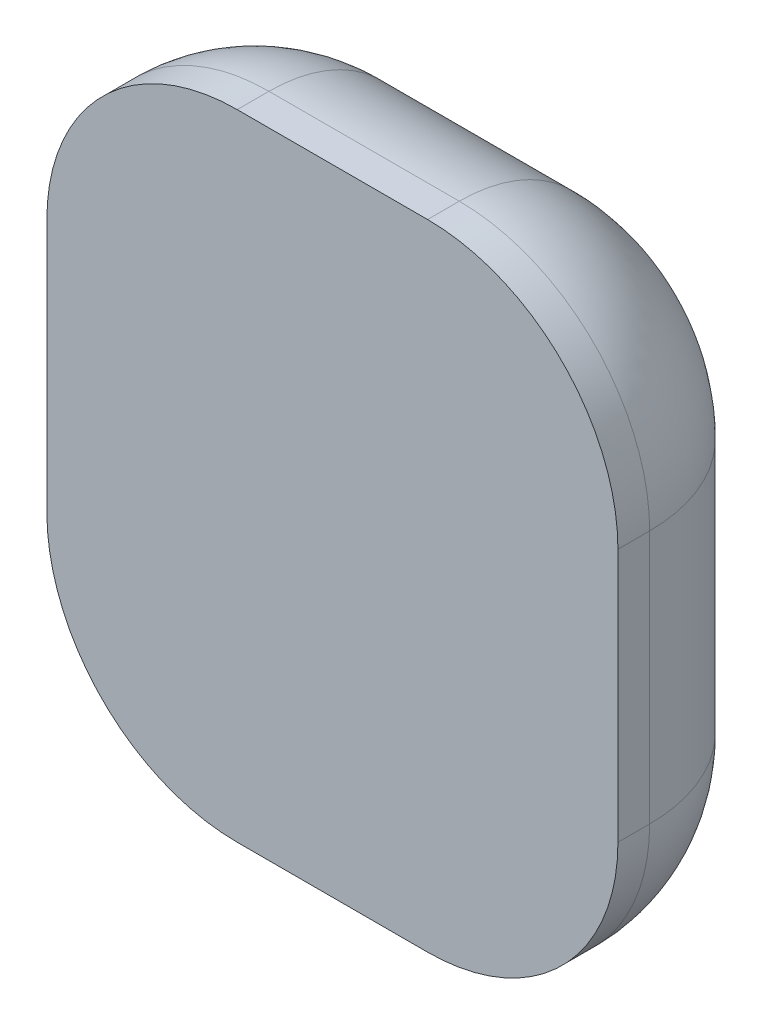
ISO-10303-21;
HEADER;
FILE_DESCRIPTION(('STEP AP214'),'2;1');
FILE_NAME('part.step','',(''),(''),'','','');
FILE_SCHEMA(('AUTOMOTIVE_DESIGN { 1 0 10303 214 1 1 1 1 }'));
ENDSEC;
DATA;
#1=APPLICATION_CONTEXT('core data for automotive mechanical design processes');
#2=APPLICATION_PROTOCOL_DEFINITION('international standard','automotive_design',2000,#1);
#3=PRODUCT_CONTEXT('',#1,'mechanical');
#4=PRODUCT('Part','Part','',(#3));
#5=PRODUCT_RELATED_PRODUCT_CATEGORY('part','',(#4));
#6=PRODUCT_DEFINITION_FORMATION('','',#4);
#7=PRODUCT_DEFINITION_CONTEXT('part definition',#1,'design');
#8=PRODUCT_DEFINITION('design','',#6,#7);
#9=PRODUCT_DEFINITION_SHAPE('','',#8);
#10=(LENGTH_UNIT() NAMED_UNIT(*) SI_UNIT(.MILLI.,.METRE.));
#11=(NAMED_UNIT(*) PLANE_ANGLE_UNIT() SI_UNIT($,.RADIAN.));
#12=(NAMED_UNIT(*) SI_UNIT($,.STERADIAN.) SOLID_ANGLE_UNIT());
#13=UNCERTAINTY_MEASURE_WITH_UNIT(LENGTH_MEASURE(1.E-05),#10,'distance_accuracy_value','');
#14=(GEOMETRIC_REPRESENTATION_CONTEXT(3) GLOBAL_UNCERTAINTY_ASSIGNED_CONTEXT((#13)) GLOBAL_UNIT_ASSIGNED_CONTEXT((#10,
#11,#12)) REPRESENTATION_CONTEXT('',''));
#15=CARTESIAN_POINT('',(0.,0.,0.));
#16=DIRECTION('',(0.,0.,1.));
#17=DIRECTION('',(1.,0.,0.));
#18=AXIS2_PLACEMENT_3D('',#15,#16,#17);
#19=CARTESIAN_POINT('',(5.64899999924089,-1.74899999924089,-7.3));
#20=DIRECTION('',(0.,0.,-1.));
#21=DIRECTION('',(1.,0.,0.));
#22=AXIS2_PLACEMENT_3D('',#19,#20,#21);
#23=PLANE('',#22);
#24=DIRECTION('',(0.,-1.,0.));
#25=VECTOR('',#24,1.);
#26=CARTESIAN_POINT('',(5.65,-2.,-7.3));
#27=LINE('',#26,#25);
#28=CARTESIAN_POINT('',(5.65,-1.8,-7.3));
#29=VERTEX_POINT('',#28);
#30=CARTESIAN_POINT('',(5.65,-2.19999999908368,-7.3));
#31=VERTEX_POINT('',#30);
#32=EDGE_CURVE('E125',#29,#31,#27,.T.);
#33=ORIENTED_EDGE('',*,*,#32,.F.);
#34=CARTESIAN_POINT('',(5.7,-1.8,-7.3));
#35=DIRECTION('',(0.,0.,-1.));
#36=DIRECTION('',(-1.,0.,0.));
#37=AXIS2_PLACEMENT_3D('',#34,#35,#36);
#38=CIRCLE('',#37,0.05);
#39=CARTESIAN_POINT('',(5.70000000091632,-1.75,-7.3));
#40=VERTEX_POINT('',#39);
#41=EDGE_CURVE('E148',#40,#29,#38,.F.);
#42=ORIENTED_EDGE('',*,*,#41,.F.);
#43=DIRECTION('',(-1.,0.,0.));
#44=VECTOR('',#43,1.);
#45=CARTESIAN_POINT('',(5.85,-1.75,-7.3));
#46=LINE('',#45,#44);
#47=CARTESIAN_POINT('',(6.,-1.75,-7.3));
#48=VERTEX_POINT('',#47);
#49=EDGE_CURVE('E92',#48,#40,#46,.T.);
#50=ORIENTED_EDGE('',*,*,#49,.F.);
#51=CARTESIAN_POINT('',(6.,-1.8,-7.3));
#52=DIRECTION('',(0.,0.,-1.));
#53=DIRECTION('',(-1.,0.,0.));
#54=AXIS2_PLACEMENT_3D('',#51,#52,#53);
#55=CIRCLE('',#54,0.0499999999999998);
#56=CARTESIAN_POINT('',(6.05,-1.8,-7.3));
#57=VERTEX_POINT('',#56);
#58=EDGE_CURVE('E21',#57,#48,#55,.F.);
#59=ORIENTED_EDGE('',*,*,#58,.F.);
#60=DIRECTION('',(0.,1.,0.));
#61=VECTOR('',#60,1.);
#62=CARTESIAN_POINT('',(6.05,-2.,-7.3));
#63=LINE('',#62,#61);
#64=CARTESIAN_POINT('',(6.05,-2.2,-7.3));
#65=VERTEX_POINT('',#64);
#66=EDGE_CURVE('E89',#65,#57,#63,.T.);
#67=ORIENTED_EDGE('',*,*,#66,.F.);
#68=CARTESIAN_POINT('',(6.,-2.2,-7.3));
#69=DIRECTION('',(0.,0.,-1.));
#70=DIRECTION('',(-1.,0.,0.));
#71=AXIS2_PLACEMENT_3D('',#68,#69,#70);
#72=CIRCLE('',#71,0.0500000000000002);
#73=CARTESIAN_POINT('',(5.99999999908368,-2.25,-7.3));
#74=VERTEX_POINT('',#73);
#75=EDGE_CURVE('E109',#74,#65,#72,.F.);
#76=ORIENTED_EDGE('',*,*,#75,.F.);
#77=DIRECTION('',(1.,0.,0.));
#78=VECTOR('',#77,1.);
#79=CARTESIAN_POINT('',(5.85,-2.25,-7.3));
#80=LINE('',#79,#78);
#81=CARTESIAN_POINT('',(5.7,-2.25,-7.3));
#82=VERTEX_POINT('',#81);
#83=EDGE_CURVE('E121',#82,#74,#80,.T.);
#84=ORIENTED_EDGE('',*,*,#83,.F.);
#85=CARTESIAN_POINT('',(5.7,-2.2,-7.3));
#86=DIRECTION('',(0.,0.,-1.));
#87=DIRECTION('',(-1.,0.,0.));
#88=AXIS2_PLACEMENT_3D('',#85,#86,#87);
#89=CIRCLE('',#88,0.0500000000000006);
#90=EDGE_CURVE('E147',#31,#82,#89,.F.);
#91=ORIENTED_EDGE('',*,*,#90,.F.);
#92=EDGE_LOOP('',(#33,#42,#50,#59,#67,#76,#84,#91));
#93=FACE_BOUND('',#92,.T.);
#94=ADVANCED_FACE('F17',(#93),#23,.T.);
#95=CARTESIAN_POINT('',(6.,-1.8,-7.05));
#96=DIRECTION('',(0.,0.,-1.));
#97=DIRECTION('',(-1.,0.,0.));
#98=AXIS2_PLACEMENT_3D('',#95,#96,#97);
#99=DEGENERATE_TOROIDAL_SURFACE('',#98,0.0500000000000003,0.25,.T.);
#100=CARTESIAN_POINT('',(6.05,-1.8,-7.05));
#101=DIRECTION('',(0.,-1.,0.));
#102=DIRECTION('',(0.,0.,-1.));
#103=AXIS2_PLACEMENT_3D('',#100,#101,#102);
#104=CIRCLE('',#103,0.25);
#105=CARTESIAN_POINT('',(6.3,-1.8,-7.05));
#106=VERTEX_POINT('',#105);
#107=EDGE_CURVE('E99',#57,#106,#104,.T.);
#108=ORIENTED_EDGE('',*,*,#107,.F.);
#109=ORIENTED_EDGE('',*,*,#58,.T.);
#110=CARTESIAN_POINT('',(6.,-1.75,-7.05));
#111=DIRECTION('',(-1.,0.,0.));
#112=DIRECTION('',(0.,0.,1.));
#113=AXIS2_PLACEMENT_3D('',#110,#111,#112);
#114=CIRCLE('',#113,0.25);
#115=CARTESIAN_POINT('',(6.,-1.5,-7.05));
#116=VERTEX_POINT('',#115);
#117=EDGE_CURVE('E96',#116,#48,#114,.T.);
#118=ORIENTED_EDGE('',*,*,#117,.F.);
#119=CARTESIAN_POINT('',(6.,-1.8,-7.05));
#120=DIRECTION('',(0.,0.,1.));
#121=DIRECTION('',(1.,0.,0.));
#122=AXIS2_PLACEMENT_3D('',#119,#120,#121);
#123=CIRCLE('',#122,0.3);
#124=EDGE_CURVE('E103',#106,#116,#123,.T.);
#125=ORIENTED_EDGE('',*,*,#124,.F.);
#126=EDGE_LOOP('',(#108,#109,#118,#125));
#127=FACE_BOUND('',#126,.T.);
#128=ADVANCED_FACE('F100',(#127),#99,.T.);
#129=CARTESIAN_POINT('',(5.7,-1.75,-7.05));
#130=DIRECTION('',(1.,0.,0.));
#131=DIRECTION('',(0.,0.,-1.));
#132=AXIS2_PLACEMENT_3D('',#129,#130,#131);
#133=CYLINDRICAL_SURFACE('',#132,0.25);
#134=ORIENTED_EDGE('',*,*,#117,.T.);
#135=ORIENTED_EDGE('',*,*,#49,.T.);
#136=CARTESIAN_POINT('',(5.70000000183265,-1.75,-7.05));
#137=DIRECTION('',(-0.999999999999999,3.66530764073225E-08,0.));
#138=DIRECTION('',(-3.66530764073225E-08,-0.999999999999999,0.));
#139=AXIS2_PLACEMENT_3D('',#136,#137,#138);
#140=CIRCLE('',#139,0.25);
#141=CARTESIAN_POINT('',(5.70000000274898,-1.5,-7.05));
#142=VERTEX_POINT('',#141);
#143=EDGE_CURVE('E130',#142,#40,#140,.T.);
#144=ORIENTED_EDGE('',*,*,#143,.F.);
#145=DIRECTION('',(-1.,0.,0.));
#146=VECTOR('',#145,1.);
#147=CARTESIAN_POINT('',(5.85,-1.5,-7.05));
#148=LINE('',#147,#146);
#149=EDGE_CURVE('E114',#116,#142,#148,.T.);
#150=ORIENTED_EDGE('',*,*,#149,.F.);
#151=EDGE_LOOP('',(#134,#135,#144,#150));
#152=FACE_BOUND('',#151,.T.);
#153=ADVANCED_FACE('F169',(#152),#133,.T.);
#154=CARTESIAN_POINT('',(5.7,-1.8,-7.05));
#155=DIRECTION('',(0.,0.,-1.));
#156=DIRECTION('',(-1.,0.,0.));
#157=AXIS2_PLACEMENT_3D('',#154,#155,#156);
#158=DEGENERATE_TOROIDAL_SURFACE('',#157,0.0500000000000006,0.25,.T.);
#159=ORIENTED_EDGE('',*,*,#143,.T.);
#160=ORIENTED_EDGE('',*,*,#41,.T.);
#161=CARTESIAN_POINT('',(5.65,-1.8,-7.05));
#162=DIRECTION('',(0.,-1.,0.));
#163=DIRECTION('',(0.,0.,-1.));
#164=AXIS2_PLACEMENT_3D('',#161,#162,#163);
#165=CIRCLE('',#164,0.25);
#166=CARTESIAN_POINT('',(5.4,-1.8,-7.05));
#167=VERTEX_POINT('',#166);
#168=EDGE_CURVE('E128',#167,#29,#165,.T.);
#169=ORIENTED_EDGE('',*,*,#168,.F.);
#170=CARTESIAN_POINT('',(5.7,-1.8,-7.05));
#171=DIRECTION('',(0.,0.,1.));
#172=DIRECTION('',(1.,0.,0.));
#173=AXIS2_PLACEMENT_3D('',#170,#171,#172);
#174=CIRCLE('',#173,0.3);
#175=EDGE_CURVE('E227',#142,#167,#174,.T.);
#176=ORIENTED_EDGE('',*,*,#175,.F.);
#177=EDGE_LOOP('',(#159,#160,#169,#176));
#178=FACE_BOUND('',#177,.T.);
#179=ADVANCED_FACE('F315',(#178),#158,.T.);
#180=CARTESIAN_POINT('',(5.65,-2.2,-7.05));
#181=DIRECTION('',(0.,1.,0.));
#182=DIRECTION('',(0.,0.,1.));
#183=AXIS2_PLACEMENT_3D('',#180,#181,#182);
#184=CYLINDRICAL_SURFACE('',#183,0.25);
#185=ORIENTED_EDGE('',*,*,#168,.T.);
#186=ORIENTED_EDGE('',*,*,#32,.T.);
#187=CARTESIAN_POINT('',(5.65,-2.19999999816735,-7.05));
#188=DIRECTION('',(-3.66530833462165E-08,-0.999999999999999,0.));
#189=DIRECTION('',(0.999999999999999,-3.66530833462165E-08,0.));
#190=AXIS2_PLACEMENT_3D('',#187,#188,#189);
#191=CIRCLE('',#190,0.25);
#192=CARTESIAN_POINT('',(5.4,-2.19999999725102,-7.05));
#193=VERTEX_POINT('',#192);
#194=EDGE_CURVE('E127',#193,#31,#191,.T.);
#195=ORIENTED_EDGE('',*,*,#194,.F.);
#196=DIRECTION('',(0.,-1.,0.));
#197=VECTOR('',#196,1.);
#198=CARTESIAN_POINT('',(5.4,-2.,-7.05));
#199=LINE('',#198,#197);
#200=EDGE_CURVE('E221',#167,#193,#199,.T.);
#201=ORIENTED_EDGE('',*,*,#200,.F.);
#202=EDGE_LOOP('',(#185,#186,#195,#201));
#203=FACE_BOUND('',#202,.T.);
#204=ADVANCED_FACE('F280',(#203),#184,.T.);
#205=CARTESIAN_POINT('',(5.7,-2.2,-7.05));
#206=DIRECTION('',(0.,0.,-1.));
#207=DIRECTION('',(-1.,0.,0.));
#208=AXIS2_PLACEMENT_3D('',#205,#206,#207);
#209=DEGENERATE_TOROIDAL_SURFACE('',#208,0.0500000000000045,0.25,.T.);
#210=ORIENTED_EDGE('',*,*,#194,.T.);
#211=ORIENTED_EDGE('',*,*,#90,.T.);
#212=CARTESIAN_POINT('',(5.7,-2.25,-7.05));
#213=DIRECTION('',(1.,0.,0.));
#214=DIRECTION('',(0.,1.,0.));
#215=AXIS2_PLACEMENT_3D('',#212,#213,#214);
#216=CIRCLE('',#215,0.25);
#217=CARTESIAN_POINT('',(5.7,-2.5,-7.05));
#218=VERTEX_POINT('',#217);
#219=EDGE_CURVE('E124',#218,#82,#216,.T.);
#220=ORIENTED_EDGE('',*,*,#219,.F.);
#221=CARTESIAN_POINT('',(5.7,-2.2,-7.05));
#222=DIRECTION('',(0.,0.,1.));
#223=DIRECTION('',(1.,0.,0.));
#224=AXIS2_PLACEMENT_3D('',#221,#222,#223);
#225=CIRCLE('',#224,0.3);
#226=EDGE_CURVE('E220',#193,#218,#225,.T.);
#227=ORIENTED_EDGE('',*,*,#226,.F.);
#228=EDGE_LOOP('',(#210,#211,#220,#227));
#229=FACE_BOUND('',#228,.T.);
#230=ADVANCED_FACE('F304',(#229),#209,.T.);
#231=CARTESIAN_POINT('',(5.7,-2.25,-7.05));
#232=DIRECTION('',(1.,0.,0.));
#233=DIRECTION('',(0.,1.,0.));
#234=AXIS2_PLACEMENT_3D('',#231,#232,#233);
#235=CYLINDRICAL_SURFACE('',#234,0.25);
#236=ORIENTED_EDGE('',*,*,#219,.T.);
#237=ORIENTED_EDGE('',*,*,#83,.T.);
#238=CARTESIAN_POINT('',(5.99999999816735,-2.25,-7.05));
#239=DIRECTION('',(0.999999999999999,-3.66530764073225E-08,0.));
#240=DIRECTION('',(3.66530764073225E-08,0.999999999999999,0.));
#241=AXIS2_PLACEMENT_3D('',#238,#239,#240);
#242=CIRCLE('',#241,0.25);
#243=CARTESIAN_POINT('',(5.99999999725102,-2.5,-7.05));
#244=VERTEX_POINT('',#243);
#245=EDGE_CURVE('E123',#244,#74,#242,.T.);
#246=ORIENTED_EDGE('',*,*,#245,.F.);
#247=DIRECTION('',(1.,0.,0.));
#248=VECTOR('',#247,1.);
#249=CARTESIAN_POINT('',(5.85,-2.5,-7.05));
#250=LINE('',#249,#248);
#251=EDGE_CURVE('E214',#218,#244,#250,.T.);
#252=ORIENTED_EDGE('',*,*,#251,.F.);
#253=EDGE_LOOP('',(#236,#237,#246,#252));
#254=FACE_BOUND('',#253,.T.);
#255=ADVANCED_FACE('F300',(#254),#235,.T.);
#256=CARTESIAN_POINT('',(6.,-2.2,-7.05));
#257=DIRECTION('',(0.,0.,-1.));
#258=DIRECTION('',(-1.,0.,0.));
#259=AXIS2_PLACEMENT_3D('',#256,#257,#258);
#260=DEGENERATE_TOROIDAL_SURFACE('',#259,0.0499999999999988,0.25,.T.);
#261=ORIENTED_EDGE('',*,*,#245,.T.);
#262=ORIENTED_EDGE('',*,*,#75,.T.);
#263=CARTESIAN_POINT('',(6.05,-2.2,-7.05));
#264=DIRECTION('',(0.,1.,0.));
#265=DIRECTION('',(0.,0.,1.));
#266=AXIS2_PLACEMENT_3D('',#263,#264,#265);
#267=CIRCLE('',#266,0.25);
#268=CARTESIAN_POINT('',(6.3,-2.2,-7.05));
#269=VERTEX_POINT('',#268);
#270=EDGE_CURVE('E108',#269,#65,#267,.T.);
#271=ORIENTED_EDGE('',*,*,#270,.F.);
#272=CARTESIAN_POINT('',(6.,-2.2,-7.05));
#273=DIRECTION('',(0.,0.,1.));
#274=DIRECTION('',(1.,0.,0.));
#275=AXIS2_PLACEMENT_3D('',#272,#273,#274);
#276=CIRCLE('',#275,0.3);
#277=EDGE_CURVE('E189',#244,#269,#276,.T.);
#278=ORIENTED_EDGE('',*,*,#277,.F.);
#279=EDGE_LOOP('',(#261,#262,#271,#278));
#280=FACE_BOUND('',#279,.T.);
#281=ADVANCED_FACE('F188',(#280),#260,.T.);
#282=CARTESIAN_POINT('',(6.05,-1.8,-7.05));
#283=DIRECTION('',(0.,-1.,0.));
#284=DIRECTION('',(0.,0.,-1.));
#285=AXIS2_PLACEMENT_3D('',#282,#283,#284);
#286=CYLINDRICAL_SURFACE('',#285,0.25);
#287=ORIENTED_EDGE('',*,*,#270,.T.);
#288=ORIENTED_EDGE('',*,*,#66,.T.);
#289=ORIENTED_EDGE('',*,*,#107,.T.);
#290=DIRECTION('',(0.,1.,0.));
#291=VECTOR('',#290,1.);
#292=CARTESIAN_POINT('',(6.3,-2.,-7.05));
#293=LINE('',#292,#291);
#294=EDGE_CURVE('E145',#269,#106,#293,.T.);
#295=ORIENTED_EDGE('',*,*,#294,.F.);
#296=EDGE_LOOP('',(#287,#288,#289,#295));
#297=FACE_BOUND('',#296,.T.);
#298=ADVANCED_FACE('F111',(#297),#286,.T.);
#299=CARTESIAN_POINT('',(6.,-1.8,-7.05));
#300=DIRECTION('',(0.,0.,1.));
#301=DIRECTION('',(1.,0.,0.));
#302=AXIS2_PLACEMENT_3D('',#299,#300,#301);
#303=CYLINDRICAL_SURFACE('',#302,0.3);
#304=DIRECTION('',(0.,0.,1.));
#305=VECTOR('',#304,1.);
#306=CARTESIAN_POINT('',(6.3,-1.8,-7.025));
#307=LINE('',#306,#305);
#308=CARTESIAN_POINT('',(6.3,-1.8,-7.));
#309=VERTEX_POINT('',#308);
#310=EDGE_CURVE('E193',#106,#309,#307,.T.);
#311=ORIENTED_EDGE('',*,*,#310,.F.);
#312=ORIENTED_EDGE('',*,*,#124,.T.);
#313=DIRECTION('',(0.,0.,-1.));
#314=VECTOR('',#313,1.);
#315=CARTESIAN_POINT('',(6.,-1.5,-7.025));
#316=LINE('',#315,#314);
#317=CARTESIAN_POINT('',(6.,-1.5,-7.));
#318=VERTEX_POINT('',#317);
#319=EDGE_CURVE('E165',#318,#116,#316,.T.);
#320=ORIENTED_EDGE('',*,*,#319,.F.);
#321=CARTESIAN_POINT('',(6.,-1.8,-7.));
#322=DIRECTION('',(0.,0.,1.));
#323=DIRECTION('',(1.,0.,0.));
#324=AXIS2_PLACEMENT_3D('',#321,#322,#323);
#325=CIRCLE('',#324,0.3);
#326=EDGE_CURVE('E142',#309,#318,#325,.T.);
#327=ORIENTED_EDGE('',*,*,#326,.F.);
#328=EDGE_LOOP('',(#311,#312,#320,#327));
#329=FACE_BOUND('',#328,.T.);
#330=ADVANCED_FACE('F292',(#329),#303,.T.);
#331=CARTESIAN_POINT('',(5.699,-1.5,-6.999));
#332=DIRECTION('',(0.,1.,0.));
#333=DIRECTION('',(1.,0.,0.));
#334=AXIS2_PLACEMENT_3D('',#331,#332,#333);
#335=PLANE('',#334);
#336=DIRECTION('',(-1.,0.,0.));
#337=VECTOR('',#336,1.);
#338=CARTESIAN_POINT('',(5.85,-1.5,-7.));
#339=LINE('',#338,#337);
#340=CARTESIAN_POINT('',(5.7,-1.5,-7.));
#341=VERTEX_POINT('',#340);
#342=EDGE_CURVE('E141',#318,#341,#339,.T.);
#343=ORIENTED_EDGE('',*,*,#342,.F.);
#344=ORIENTED_EDGE('',*,*,#319,.T.);
#345=ORIENTED_EDGE('',*,*,#149,.T.);
#346=DIRECTION('',(0.,0.,-1.));
#347=VECTOR('',#346,1.);
#348=CARTESIAN_POINT('',(5.7,-1.5,-7.025));
#349=LINE('',#348,#347);
#350=EDGE_CURVE('E230',#341,#142,#349,.T.);
#351=ORIENTED_EDGE('',*,*,#350,.F.);
#352=EDGE_LOOP('',(#343,#344,#345,#351));
#353=FACE_BOUND('',#352,.T.);
#354=ADVANCED_FACE('F290',(#353),#335,.T.);
#355=CARTESIAN_POINT('',(5.7,-1.8,-7.05));
#356=DIRECTION('',(0.,0.,1.));
#357=DIRECTION('',(1.,0.,0.));
#358=AXIS2_PLACEMENT_3D('',#355,#356,#357);
#359=CYLINDRICAL_SURFACE('',#358,0.3);
#360=ORIENTED_EDGE('',*,*,#350,.T.);
#361=ORIENTED_EDGE('',*,*,#175,.T.);
#362=DIRECTION('',(0.,0.,-1.));
#363=VECTOR('',#362,1.);
#364=CARTESIAN_POINT('',(5.4,-1.8,-7.025));
#365=LINE('',#364,#363);
#366=CARTESIAN_POINT('',(5.4,-1.8,-7.));
#367=VERTEX_POINT('',#366);
#368=EDGE_CURVE('E224',#367,#167,#365,.T.);
#369=ORIENTED_EDGE('',*,*,#368,.F.);
#370=CARTESIAN_POINT('',(5.7,-1.8,-7.));
#371=DIRECTION('',(0.,0.,1.));
#372=DIRECTION('',(1.,0.,0.));
#373=AXIS2_PLACEMENT_3D('',#370,#371,#372);
#374=CIRCLE('',#373,0.3);
#375=EDGE_CURVE('E138',#341,#367,#374,.T.);
#376=ORIENTED_EDGE('',*,*,#375,.F.);
#377=EDGE_LOOP('',(#360,#361,#369,#376));
#378=FACE_BOUND('',#377,.T.);
#379=ADVANCED_FACE('F276',(#378),#359,.T.);
#380=CARTESIAN_POINT('',(5.4,-2.201,-6.999));
#381=DIRECTION('',(-1.,0.,0.));
#382=DIRECTION('',(0.,1.,0.));
#383=AXIS2_PLACEMENT_3D('',#380,#381,#382);
#384=PLANE('',#383);
#385=ORIENTED_EDGE('',*,*,#368,.T.);
#386=ORIENTED_EDGE('',*,*,#200,.T.);
#387=DIRECTION('',(0.,0.,-1.));
#388=VECTOR('',#387,1.);
#389=CARTESIAN_POINT('',(5.4,-2.2,-7.025));
#390=LINE('',#389,#388);
#391=CARTESIAN_POINT('',(5.4,-2.2,-7.));
#392=VERTEX_POINT('',#391);
#393=EDGE_CURVE('E217',#392,#193,#390,.T.);
#394=ORIENTED_EDGE('',*,*,#393,.F.);
#395=DIRECTION('',(0.,-1.,0.));
#396=VECTOR('',#395,1.);
#397=CARTESIAN_POINT('',(5.4,-2.,-7.));
#398=LINE('',#397,#396);
#399=EDGE_CURVE('E137',#367,#392,#398,.T.);
#400=ORIENTED_EDGE('',*,*,#399,.F.);
#401=EDGE_LOOP('',(#385,#386,#394,#400));
#402=FACE_BOUND('',#401,.T.);
#403=ADVANCED_FACE('F283',(#402),#384,.T.);
#404=CARTESIAN_POINT('',(5.7,-2.2,-7.05));
#405=DIRECTION('',(0.,0.,1.));
#406=DIRECTION('',(1.,0.,0.));
#407=AXIS2_PLACEMENT_3D('',#404,#405,#406);
#408=CYLINDRICAL_SURFACE('',#407,0.3);
#409=ORIENTED_EDGE('',*,*,#393,.T.);
#410=ORIENTED_EDGE('',*,*,#226,.T.);
#411=DIRECTION('',(0.,0.,-1.));
#412=VECTOR('',#411,1.);
#413=CARTESIAN_POINT('',(5.7,-2.5,-7.025));
#414=LINE('',#413,#412);
#415=CARTESIAN_POINT('',(5.7,-2.5,-7.));
#416=VERTEX_POINT('',#415);
#417=EDGE_CURVE('E209',#416,#218,#414,.T.);
#418=ORIENTED_EDGE('',*,*,#417,.F.);
#419=CARTESIAN_POINT('',(5.7,-2.2,-7.));
#420=DIRECTION('',(0.,0.,1.));
#421=DIRECTION('',(1.,0.,0.));
#422=AXIS2_PLACEMENT_3D('',#419,#420,#421);
#423=CIRCLE('',#422,0.3);
#424=EDGE_CURVE('E134',#392,#416,#423,.T.);
#425=ORIENTED_EDGE('',*,*,#424,.F.);
#426=EDGE_LOOP('',(#409,#410,#418,#425));
#427=FACE_BOUND('',#426,.T.);
#428=ADVANCED_FACE('F302',(#427),#408,.T.);
#429=CARTESIAN_POINT('',(6.001,-2.5,-6.999));
#430=DIRECTION('',(0.,-1.,0.));
#431=DIRECTION('',(-1.,0.,0.));
#432=AXIS2_PLACEMENT_3D('',#429,#430,#431);
#433=PLANE('',#432);
#434=DIRECTION('',(1.,0.,0.));
#435=VECTOR('',#434,1.);
#436=CARTESIAN_POINT('',(5.85,-2.5,-7.));
#437=LINE('',#436,#435);
#438=CARTESIAN_POINT('',(6.,-2.5,-7.));
#439=VERTEX_POINT('',#438);
#440=EDGE_CURVE('E133',#416,#439,#437,.T.);
#441=ORIENTED_EDGE('',*,*,#440,.F.);
#442=ORIENTED_EDGE('',*,*,#417,.T.);
#443=ORIENTED_EDGE('',*,*,#251,.T.);
#444=DIRECTION('',(0.,0.,-1.));
#445=VECTOR('',#444,1.);
#446=CARTESIAN_POINT('',(6.,-2.5,-7.025));
#447=LINE('',#446,#445);
#448=EDGE_CURVE('E192',#439,#244,#447,.T.);
#449=ORIENTED_EDGE('',*,*,#448,.F.);
#450=EDGE_LOOP('',(#441,#442,#443,#449));
#451=FACE_BOUND('',#450,.T.);
#452=ADVANCED_FACE('F297',(#451),#433,.T.);
#453=CARTESIAN_POINT('',(6.,-2.2,-7.05));
#454=DIRECTION('',(0.,0.,1.));
#455=DIRECTION('',(1.,0.,0.));
#456=AXIS2_PLACEMENT_3D('',#453,#454,#455);
#457=CYLINDRICAL_SURFACE('',#456,0.3);
#458=ORIENTED_EDGE('',*,*,#448,.T.);
#459=ORIENTED_EDGE('',*,*,#277,.T.);
#460=DIRECTION('',(0.,0.,-1.));
#461=VECTOR('',#460,1.);
#462=CARTESIAN_POINT('',(6.3,-2.2,-7.025));
#463=LINE('',#462,#461);
#464=CARTESIAN_POINT('',(6.3,-2.2,-7.));
#465=VERTEX_POINT('',#464);
#466=EDGE_CURVE('E36',#465,#269,#463,.T.);
#467=ORIENTED_EDGE('',*,*,#466,.F.);
#468=CARTESIAN_POINT('',(6.,-2.2,-7.));
#469=DIRECTION('',(0.,0.,1.));
#470=DIRECTION('',(1.,0.,0.));
#471=AXIS2_PLACEMENT_3D('',#468,#469,#470);
#472=CIRCLE('',#471,0.3);
#473=EDGE_CURVE('E27',#439,#465,#472,.T.);
#474=ORIENTED_EDGE('',*,*,#473,.F.);
#475=EDGE_LOOP('',(#458,#459,#467,#474));
#476=FACE_BOUND('',#475,.T.);
#477=ADVANCED_FACE('F191',(#476),#457,.T.);
#478=CARTESIAN_POINT('',(6.3,-1.799,-6.999));
#479=DIRECTION('',(1.,0.,0.));
#480=DIRECTION('',(0.,-1.,0.));
#481=AXIS2_PLACEMENT_3D('',#478,#479,#480);
#482=PLANE('',#481);
#483=ORIENTED_EDGE('',*,*,#466,.T.);
#484=ORIENTED_EDGE('',*,*,#294,.T.);
#485=ORIENTED_EDGE('',*,*,#310,.T.);
#486=DIRECTION('',(0.,1.,0.));
#487=VECTOR('',#486,1.);
#488=CARTESIAN_POINT('',(6.3,-2.,-7.));
#489=LINE('',#488,#487);
#490=EDGE_CURVE('E11',#465,#309,#489,.T.);
#491=ORIENTED_EDGE('',*,*,#490,.F.);
#492=EDGE_LOOP('',(#483,#484,#485,#491));
#493=FACE_BOUND('',#492,.T.);
#494=ADVANCED_FACE('F198',(#493),#482,.T.);
#495=CARTESIAN_POINT('',(6.301,-1.499,-7.));
#496=DIRECTION('',(0.,0.,1.));
#497=DIRECTION('',(-1.,0.,0.));
#498=AXIS2_PLACEMENT_3D('',#495,#496,#497);
#499=PLANE('',#498);
#500=ORIENTED_EDGE('',*,*,#473,.T.);
#501=ORIENTED_EDGE('',*,*,#490,.T.);
#502=ORIENTED_EDGE('',*,*,#326,.T.);
#503=ORIENTED_EDGE('',*,*,#342,.T.);
#504=ORIENTED_EDGE('',*,*,#375,.T.);
#505=ORIENTED_EDGE('',*,*,#399,.T.);
#506=ORIENTED_EDGE('',*,*,#424,.T.);
#507=ORIENTED_EDGE('',*,*,#440,.T.);
#508=EDGE_LOOP('',(#500,#501,#502,#503,#504,#505,#506,#507));
#509=FACE_BOUND('',#508,.T.);
#510=ADVANCED_FACE('F19',(#509),#499,.T.);
#511=CLOSED_SHELL('',(#94,#128,#153,#179,#204,#230,#255,#281,#298,#330,#354,#379,#403,#428,#452,
#477,#494,#510));
#512=MANIFOLD_SOLID_BREP('B1',#511);
#513=ADVANCED_BREP_SHAPE_REPRESENTATION('',(#18,#512),#14);
#514=SHAPE_DEFINITION_REPRESENTATION(#9,#513);
ENDSEC;
END-ISO-10303-21;
